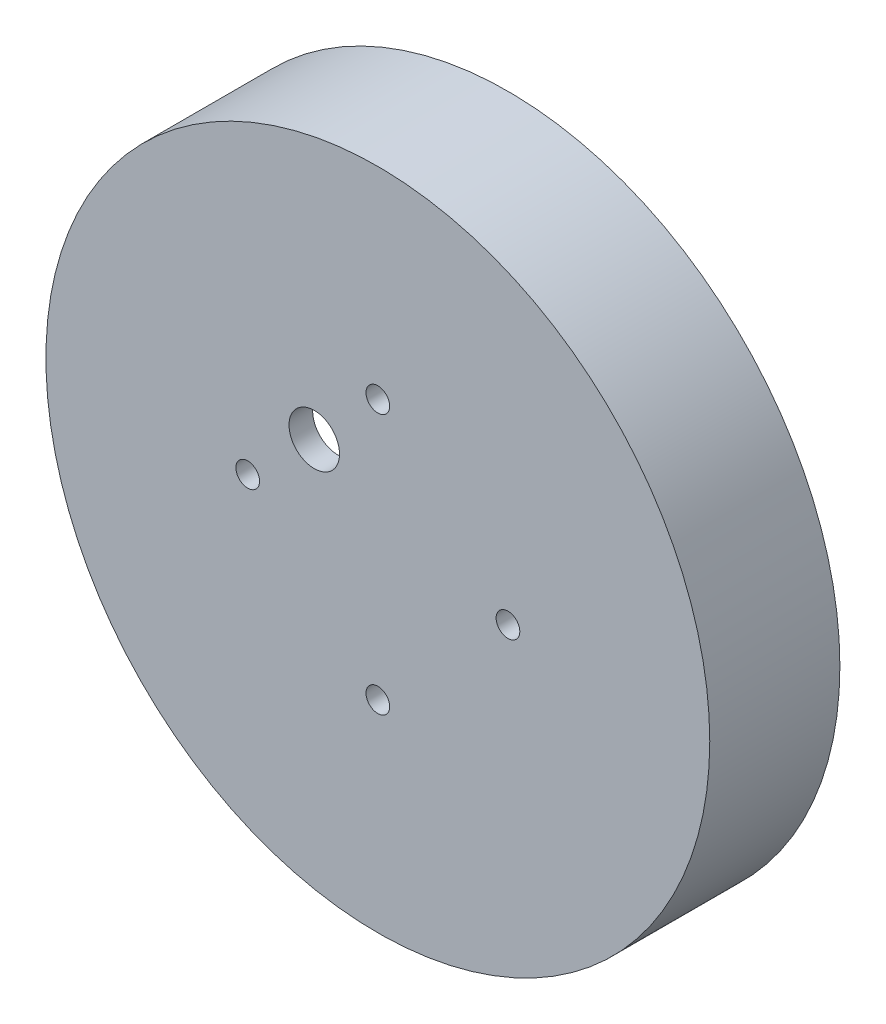
ISO-10303-21;
HEADER;
FILE_DESCRIPTION(('STEP AP214'),'2;1');
FILE_NAME('part.step','',(''),(''),'','','');
FILE_SCHEMA(('AUTOMOTIVE_DESIGN { 1 0 10303 214 1 1 1 1 }'));
ENDSEC;
DATA;
#1=APPLICATION_CONTEXT('core data for automotive mechanical design processes');
#2=APPLICATION_PROTOCOL_DEFINITION('international standard','automotive_design',2000,#1);
#3=PRODUCT_CONTEXT('',#1,'mechanical');
#4=PRODUCT('Part','Part','',(#3));
#5=PRODUCT_RELATED_PRODUCT_CATEGORY('part','',(#4));
#6=PRODUCT_DEFINITION_FORMATION('','',#4);
#7=PRODUCT_DEFINITION_CONTEXT('part definition',#1,'design');
#8=PRODUCT_DEFINITION('design','',#6,#7);
#9=PRODUCT_DEFINITION_SHAPE('','',#8);
#10=(LENGTH_UNIT() NAMED_UNIT(*) SI_UNIT(.MILLI.,.METRE.));
#11=(NAMED_UNIT(*) PLANE_ANGLE_UNIT() SI_UNIT($,.RADIAN.));
#12=(NAMED_UNIT(*) SI_UNIT($,.STERADIAN.) SOLID_ANGLE_UNIT());
#13=UNCERTAINTY_MEASURE_WITH_UNIT(LENGTH_MEASURE(1.E-05),#10,'distance_accuracy_value','');
#14=(GEOMETRIC_REPRESENTATION_CONTEXT(3) GLOBAL_UNCERTAINTY_ASSIGNED_CONTEXT((#13)) GLOBAL_UNIT_ASSIGNED_CONTEXT((#10,
#11,#12)) REPRESENTATION_CONTEXT('',''));
#15=CARTESIAN_POINT('',(0.,0.,0.));
#16=DIRECTION('',(0.,0.,1.));
#17=DIRECTION('',(1.,0.,0.));
#18=AXIS2_PLACEMENT_3D('',#15,#16,#17);
#19=CARTESIAN_POINT('',(0.,0.,8.49999999999999));
#20=DIRECTION('',(0.,0.,-1.));
#21=DIRECTION('',(-1.,0.,0.));
#22=AXIS2_PLACEMENT_3D('',#19,#20,#21);
#23=CYLINDRICAL_SURFACE('',#22,42.0875);
#24=CARTESIAN_POINT('',(0.,0.,8.49999999999999));
#25=DIRECTION('',(0.,0.,1.));
#26=DIRECTION('',(1.,0.,0.));
#27=AXIS2_PLACEMENT_3D('',#24,#25,#26);
#28=CIRCLE('',#27,42.0875);
#29=CARTESIAN_POINT('',(42.0875,0.,8.49999999999999));
#30=VERTEX_POINT('',#29);
#31=EDGE_CURVE('E11',#30,#30,#28,.T.);
#32=ORIENTED_EDGE('',*,*,#31,.F.);
#33=EDGE_LOOP('',(#32));
#34=FACE_BOUND('',#33,.T.);
#35=CARTESIAN_POINT('',(0.,0.,-8.00000000000001));
#36=DIRECTION('',(0.,0.,1.));
#37=DIRECTION('',(1.,0.,0.));
#38=AXIS2_PLACEMENT_3D('',#35,#36,#37);
#39=CIRCLE('',#38,42.0875);
#40=CARTESIAN_POINT('',(42.0875,0.,-8.00000000000001));
#41=VERTEX_POINT('',#40);
#42=EDGE_CURVE('E40',#41,#41,#39,.T.);
#43=ORIENTED_EDGE('',*,*,#42,.T.);
#44=EDGE_LOOP('',(#43));
#45=FACE_BOUND('',#44,.T.);
#46=ADVANCED_FACE('F33',(#34,#45),#23,.T.);
#47=CARTESIAN_POINT('',(0.,0.,8.49999999999999));
#48=DIRECTION('',(0.,0.,1.));
#49=DIRECTION('',(1.,0.,0.));
#50=AXIS2_PLACEMENT_3D('',#47,#48,#49);
#51=PLANE('',#50);
#52=CARTESIAN_POINT('',(-16.5,0.,8.49999999999999));
#53=DIRECTION('',(0.,0.,-1.));
#54=DIRECTION('',(1.,0.,0.));
#55=AXIS2_PLACEMENT_3D('',#52,#53,#54);
#56=CIRCLE('',#55,1.5);
#57=CARTESIAN_POINT('',(-15.,0.,8.49999999999999));
#58=VERTEX_POINT('',#57);
#59=EDGE_CURVE('E63',#58,#58,#56,.T.);
#60=ORIENTED_EDGE('',*,*,#59,.T.);
#61=EDGE_LOOP('',(#60));
#62=FACE_BOUND('',#61,.T.);
#63=CARTESIAN_POINT('',(1.72828326272735E-13,16.5,8.49999999999999));
#64=DIRECTION('',(0.,0.,-1.));
#65=DIRECTION('',(0.,-1.,0.));
#66=AXIS2_PLACEMENT_3D('',#63,#64,#65);
#67=CIRCLE('',#66,1.5);
#68=CARTESIAN_POINT('',(1.57116660247941E-13,15.,8.49999999999999));
#69=VERTEX_POINT('',#68);
#70=EDGE_CURVE('E68',#69,#69,#67,.T.);
#71=ORIENTED_EDGE('',*,*,#70,.T.);
#72=EDGE_LOOP('',(#71));
#73=FACE_BOUND('',#72,.T.);
#74=CARTESIAN_POINT('',(0.,-16.5,8.49999999999999));
#75=DIRECTION('',(0.,0.,-1.));
#76=DIRECTION('',(0.,1.,0.));
#77=AXIS2_PLACEMENT_3D('',#74,#75,#76);
#78=CIRCLE('',#77,1.5);
#79=CARTESIAN_POINT('',(0.,-15.,8.49999999999999));
#80=VERTEX_POINT('',#79);
#81=EDGE_CURVE('E60',#80,#80,#78,.T.);
#82=ORIENTED_EDGE('',*,*,#81,.T.);
#83=EDGE_LOOP('',(#82));
#84=FACE_BOUND('',#83,.T.);
#85=CARTESIAN_POINT('',(16.5,0.,8.49999999999999));
#86=DIRECTION('',(0.,0.,-1.));
#87=DIRECTION('',(-1.,0.,0.));
#88=AXIS2_PLACEMENT_3D('',#85,#86,#87);
#89=CIRCLE('',#88,1.5);
#90=CARTESIAN_POINT('',(15.,0.,8.49999999999999));
#91=VERTEX_POINT('',#90);
#92=EDGE_CURVE('E57',#91,#91,#89,.T.);
#93=ORIENTED_EDGE('',*,*,#92,.T.);
#94=EDGE_LOOP('',(#93));
#95=FACE_BOUND('',#94,.T.);
#96=CARTESIAN_POINT('',(-8.06101730552663,8.06101730552665,8.49999999999999));
#97=DIRECTION('',(0.,0.,1.));
#98=DIRECTION('',(1.,0.,0.));
#99=AXIS2_PLACEMENT_3D('',#96,#97,#98);
#100=CIRCLE('',#99,3.2);
#101=CARTESIAN_POINT('',(-4.86101730552663,8.06101730552665,8.49999999999999));
#102=VERTEX_POINT('',#101);
#103=EDGE_CURVE('E53',#102,#102,#100,.T.);
#104=ORIENTED_EDGE('',*,*,#103,.F.);
#105=EDGE_LOOP('',(#104));
#106=FACE_BOUND('',#105,.T.);
#107=ORIENTED_EDGE('',*,*,#31,.T.);
#108=EDGE_LOOP('',(#107));
#109=FACE_BOUND('',#108,.T.);
#110=ADVANCED_FACE('F110',(#62,#73,#84,#95,#106,#109),#51,.T.);
#111=CARTESIAN_POINT('',(0.,0.,-8.00000000000001));
#112=DIRECTION('',(0.,0.,1.));
#113=DIRECTION('',(1.,0.,0.));
#114=AXIS2_PLACEMENT_3D('',#111,#112,#113);
#115=PLANE('',#114);
#116=CARTESIAN_POINT('',(0.,0.,-8.00000000000001));
#117=DIRECTION('',(0.,0.,-1.));
#118=DIRECTION('',(-1.,0.,0.));
#119=AXIS2_PLACEMENT_3D('',#116,#117,#118);
#120=CIRCLE('',#119,38.4875);
#121=CARTESIAN_POINT('',(-38.4875,0.,-8.00000000000001));
#122=VERTEX_POINT('',#121);
#123=EDGE_CURVE('E86',#122,#122,#120,.T.);
#124=ORIENTED_EDGE('',*,*,#123,.F.);
#125=EDGE_LOOP('',(#124));
#126=FACE_BOUND('',#125,.T.);
#127=ORIENTED_EDGE('',*,*,#42,.F.);
#128=EDGE_LOOP('',(#127));
#129=FACE_BOUND('',#128,.T.);
#130=ADVANCED_FACE('F106',(#126,#129),#115,.F.);
#131=CARTESIAN_POINT('',(0.,0.,0.499999999999994));
#132=DIRECTION('',(0.,0.,1.));
#133=DIRECTION('',(1.,0.,0.));
#134=AXIS2_PLACEMENT_3D('',#131,#132,#133);
#135=PLANE('',#134);
#136=CARTESIAN_POINT('',(0.,0.,0.499999999999994));
#137=DIRECTION('',(0.,0.,-1.));
#138=DIRECTION('',(-1.,0.,0.));
#139=AXIS2_PLACEMENT_3D('',#136,#137,#138);
#140=CIRCLE('',#139,34.4875);
#141=CARTESIAN_POINT('',(-34.4875,0.,0.499999999999994));
#142=VERTEX_POINT('',#141);
#143=EDGE_CURVE('E81',#142,#142,#140,.T.);
#144=ORIENTED_EDGE('',*,*,#143,.F.);
#145=EDGE_LOOP('',(#144));
#146=FACE_BOUND('',#145,.T.);
#147=CARTESIAN_POINT('',(0.,0.,0.5));
#148=DIRECTION('',(0.,0.,1.));
#149=DIRECTION('',(1.,0.,0.));
#150=AXIS2_PLACEMENT_3D('',#147,#148,#149);
#151=CIRCLE('',#150,38.4875);
#152=CARTESIAN_POINT('',(38.4875,0.,0.5));
#153=VERTEX_POINT('',#152);
#154=EDGE_CURVE('E45',#153,#153,#151,.F.);
#155=ORIENTED_EDGE('',*,*,#154,.T.);
#156=EDGE_LOOP('',(#155));
#157=FACE_BOUND('',#156,.T.);
#158=ADVANCED_FACE('F93',(#146,#157),#135,.F.);
#159=CARTESIAN_POINT('',(0.,0.,117.359088963669));
#160=DIRECTION('',(0.,0.,-1.));
#161=DIRECTION('',(-1.,0.,0.));
#162=AXIS2_PLACEMENT_3D('',#159,#160,#161);
#163=CYLINDRICAL_SURFACE('',#162,38.4875);
#164=ORIENTED_EDGE('',*,*,#123,.T.);
#165=EDGE_LOOP('',(#164));
#166=FACE_BOUND('',#165,.T.);
#167=ORIENTED_EDGE('',*,*,#154,.F.);
#168=EDGE_LOOP('',(#167));
#169=FACE_BOUND('',#168,.T.);
#170=ADVANCED_FACE('F95',(#166,#169),#163,.F.);
#171=CARTESIAN_POINT('',(0.,0.,5.49999999999999));
#172=DIRECTION('',(0.,0.,1.));
#173=DIRECTION('',(1.,0.,0.));
#174=AXIS2_PLACEMENT_3D('',#171,#172,#173);
#175=PLANE('',#174);
#176=CARTESIAN_POINT('',(-16.5,0.,5.49999999999999));
#177=DIRECTION('',(0.,0.,1.));
#178=DIRECTION('',(1.,0.,0.));
#179=AXIS2_PLACEMENT_3D('',#176,#177,#178);
#180=CIRCLE('',#179,1.5);
#181=CARTESIAN_POINT('',(-15.,0.,5.49999999999999));
#182=VERTEX_POINT('',#181);
#183=EDGE_CURVE('E36',#182,#182,#180,.T.);
#184=ORIENTED_EDGE('',*,*,#183,.T.);
#185=EDGE_LOOP('',(#184));
#186=FACE_BOUND('',#185,.T.);
#187=CARTESIAN_POINT('',(1.72828326272735E-13,16.5,5.49999999999999));
#188=DIRECTION('',(0.,0.,1.));
#189=DIRECTION('',(1.,0.,0.));
#190=AXIS2_PLACEMENT_3D('',#187,#188,#189);
#191=CIRCLE('',#190,1.5);
#192=CARTESIAN_POINT('',(1.50000000000017,16.5,5.49999999999999));
#193=VERTEX_POINT('',#192);
#194=EDGE_CURVE('E61',#193,#193,#191,.T.);
#195=ORIENTED_EDGE('',*,*,#194,.T.);
#196=EDGE_LOOP('',(#195));
#197=FACE_BOUND('',#196,.T.);
#198=CARTESIAN_POINT('',(0.,-16.5,5.49999999999999));
#199=DIRECTION('',(0.,0.,1.));
#200=DIRECTION('',(1.,0.,0.));
#201=AXIS2_PLACEMENT_3D('',#198,#199,#200);
#202=CIRCLE('',#201,1.5);
#203=CARTESIAN_POINT('',(1.49999999999994,-16.5,5.49999999999999));
#204=VERTEX_POINT('',#203);
#205=EDGE_CURVE('E58',#204,#204,#202,.T.);
#206=ORIENTED_EDGE('',*,*,#205,.T.);
#207=EDGE_LOOP('',(#206));
#208=FACE_BOUND('',#207,.T.);
#209=CARTESIAN_POINT('',(16.5,0.,5.49999999999999));
#210=DIRECTION('',(0.,0.,1.));
#211=DIRECTION('',(1.,0.,0.));
#212=AXIS2_PLACEMENT_3D('',#209,#210,#211);
#213=CIRCLE('',#212,1.5);
#214=CARTESIAN_POINT('',(18.,0.,5.49999999999999));
#215=VERTEX_POINT('',#214);
#216=EDGE_CURVE('E54',#215,#215,#213,.T.);
#217=ORIENTED_EDGE('',*,*,#216,.T.);
#218=EDGE_LOOP('',(#217));
#219=FACE_BOUND('',#218,.T.);
#220=CARTESIAN_POINT('',(-8.06101730552663,8.06101730552665,5.49999999999999));
#221=DIRECTION('',(0.,0.,1.));
#222=DIRECTION('',(1.,0.,0.));
#223=AXIS2_PLACEMENT_3D('',#220,#221,#222);
#224=CIRCLE('',#223,3.2);
#225=CARTESIAN_POINT('',(-4.86101730552663,8.06101730552665,5.49999999999999));
#226=VERTEX_POINT('',#225);
#227=EDGE_CURVE('E50',#226,#226,#224,.T.);
#228=ORIENTED_EDGE('',*,*,#227,.T.);
#229=EDGE_LOOP('',(#228));
#230=FACE_BOUND('',#229,.T.);
#231=CARTESIAN_POINT('',(0.,0.,5.49999999999999));
#232=DIRECTION('',(0.,0.,1.));
#233=DIRECTION('',(1.,0.,0.));
#234=AXIS2_PLACEMENT_3D('',#231,#232,#233);
#235=CIRCLE('',#234,34.4875);
#236=CARTESIAN_POINT('',(34.4875,0.,5.49999999999999));
#237=VERTEX_POINT('',#236);
#238=EDGE_CURVE('E84',#237,#237,#235,.F.);
#239=ORIENTED_EDGE('',*,*,#238,.T.);
#240=EDGE_LOOP('',(#239));
#241=FACE_BOUND('',#240,.T.);
#242=ADVANCED_FACE('F97',(#186,#197,#208,#219,#230,#241),#175,.F.);
#243=CARTESIAN_POINT('',(0.,0.,106.045380464684));
#244=DIRECTION('',(0.,0.,-1.));
#245=DIRECTION('',(-1.,0.,0.));
#246=AXIS2_PLACEMENT_3D('',#243,#244,#245);
#247=CYLINDRICAL_SURFACE('',#246,34.4875);
#248=ORIENTED_EDGE('',*,*,#143,.T.);
#249=EDGE_LOOP('',(#248));
#250=FACE_BOUND('',#249,.T.);
#251=ORIENTED_EDGE('',*,*,#238,.F.);
#252=EDGE_LOOP('',(#251));
#253=FACE_BOUND('',#252,.T.);
#254=ADVANCED_FACE('F103',(#250,#253),#247,.F.);
#255=CARTESIAN_POINT('',(-8.06101730552663,8.06101730552665,-8.00000000000001));
#256=DIRECTION('',(0.,0.,1.));
#257=DIRECTION('',(1.,0.,0.));
#258=AXIS2_PLACEMENT_3D('',#255,#256,#257);
#259=CYLINDRICAL_SURFACE('',#258,3.2);
#260=ORIENTED_EDGE('',*,*,#103,.T.);
#261=EDGE_LOOP('',(#260));
#262=FACE_BOUND('',#261,.T.);
#263=ORIENTED_EDGE('',*,*,#227,.F.);
#264=EDGE_LOOP('',(#263));
#265=FACE_BOUND('',#264,.T.);
#266=ADVANCED_FACE('F140',(#262,#265),#259,.F.);
#267=CARTESIAN_POINT('',(16.5,0.,8.49999999999999));
#268=DIRECTION('',(0.,0.,-1.));
#269=DIRECTION('',(-1.,0.,0.));
#270=AXIS2_PLACEMENT_3D('',#267,#268,#269);
#271=CYLINDRICAL_SURFACE('',#270,1.5);
#272=ORIENTED_EDGE('',*,*,#92,.F.);
#273=EDGE_LOOP('',(#272));
#274=FACE_BOUND('',#273,.T.);
#275=ORIENTED_EDGE('',*,*,#216,.F.);
#276=EDGE_LOOP('',(#275));
#277=FACE_BOUND('',#276,.T.);
#278=ADVANCED_FACE('F151',(#274,#277),#271,.F.);
#279=CARTESIAN_POINT('',(0.,-16.5,8.49999999999999));
#280=DIRECTION('',(0.,0.,-1.));
#281=DIRECTION('',(-1.,0.,0.));
#282=AXIS2_PLACEMENT_3D('',#279,#280,#281);
#283=CYLINDRICAL_SURFACE('',#282,1.5);
#284=ORIENTED_EDGE('',*,*,#81,.F.);
#285=EDGE_LOOP('',(#284));
#286=FACE_BOUND('',#285,.T.);
#287=ORIENTED_EDGE('',*,*,#205,.F.);
#288=EDGE_LOOP('',(#287));
#289=FACE_BOUND('',#288,.T.);
#290=ADVANCED_FACE('F160',(#286,#289),#283,.F.);
#291=CARTESIAN_POINT('',(1.72828326272735E-13,16.5,8.49999999999999));
#292=DIRECTION('',(0.,0.,-1.));
#293=DIRECTION('',(-1.,0.,0.));
#294=AXIS2_PLACEMENT_3D('',#291,#292,#293);
#295=CYLINDRICAL_SURFACE('',#294,1.5);
#296=ORIENTED_EDGE('',*,*,#70,.F.);
#297=EDGE_LOOP('',(#296));
#298=FACE_BOUND('',#297,.T.);
#299=ORIENTED_EDGE('',*,*,#194,.F.);
#300=EDGE_LOOP('',(#299));
#301=FACE_BOUND('',#300,.T.);
#302=ADVANCED_FACE('F181',(#298,#301),#295,.F.);
#303=CARTESIAN_POINT('',(-16.5,0.,8.49999999999999));
#304=DIRECTION('',(0.,0.,-1.));
#305=DIRECTION('',(-1.,0.,0.));
#306=AXIS2_PLACEMENT_3D('',#303,#304,#305);
#307=CYLINDRICAL_SURFACE('',#306,1.5);
#308=ORIENTED_EDGE('',*,*,#59,.F.);
#309=EDGE_LOOP('',(#308));
#310=FACE_BOUND('',#309,.T.);
#311=ORIENTED_EDGE('',*,*,#183,.F.);
#312=EDGE_LOOP('',(#311));
#313=FACE_BOUND('',#312,.T.);
#314=ADVANCED_FACE('F191',(#310,#313),#307,.F.);
#315=CLOSED_SHELL('',(#46,#110,#130,#158,#170,#242,#254,#266,#278,#290,#302,#314));
#316=MANIFOLD_SOLID_BREP('B2',#315);
#317=ADVANCED_BREP_SHAPE_REPRESENTATION('',(#18,#316),#14);
#318=SHAPE_DEFINITION_REPRESENTATION(#9,#317);
ENDSEC;
END-ISO-10303-21;
